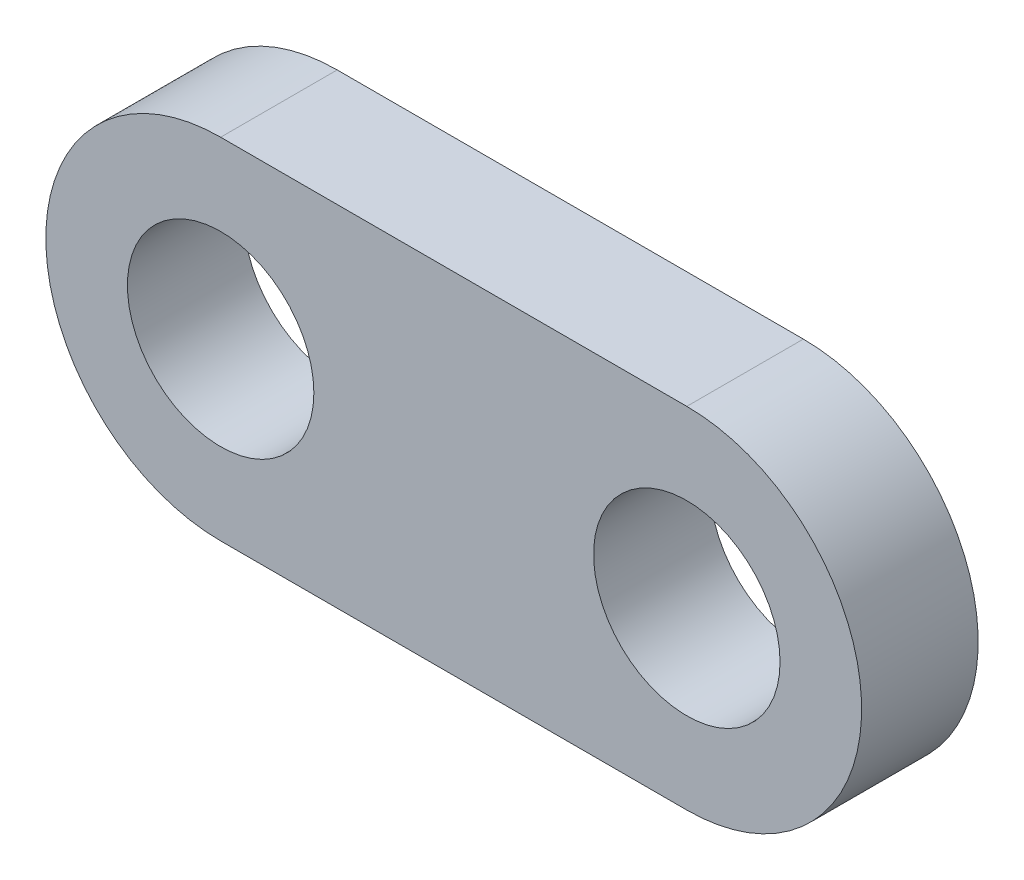
ISO-10303-21;
HEADER;
FILE_DESCRIPTION(('STEP AP214'),'2;1');
FILE_NAME('part.step','',(''),(''),'','','');
FILE_SCHEMA(('AUTOMOTIVE_DESIGN { 1 0 10303 214 1 1 1 1 }'));
ENDSEC;
DATA;
#1=APPLICATION_CONTEXT('core data for automotive mechanical design processes');
#2=APPLICATION_PROTOCOL_DEFINITION('international standard','automotive_design',2000,#1);
#3=PRODUCT_CONTEXT('',#1,'mechanical');
#4=PRODUCT('Part','Part','',(#3));
#5=PRODUCT_RELATED_PRODUCT_CATEGORY('part','',(#4));
#6=PRODUCT_DEFINITION_FORMATION('','',#4);
#7=PRODUCT_DEFINITION_CONTEXT('part definition',#1,'design');
#8=PRODUCT_DEFINITION('design','',#6,#7);
#9=PRODUCT_DEFINITION_SHAPE('','',#8);
#10=(LENGTH_UNIT() NAMED_UNIT(*) SI_UNIT(.MILLI.,.METRE.));
#11=(NAMED_UNIT(*) PLANE_ANGLE_UNIT() SI_UNIT($,.RADIAN.));
#12=(NAMED_UNIT(*) SI_UNIT($,.STERADIAN.) SOLID_ANGLE_UNIT());
#13=UNCERTAINTY_MEASURE_WITH_UNIT(LENGTH_MEASURE(1.E-05),#10,'distance_accuracy_value','');
#14=(GEOMETRIC_REPRESENTATION_CONTEXT(3) GLOBAL_UNCERTAINTY_ASSIGNED_CONTEXT((#13)) GLOBAL_UNIT_ASSIGNED_CONTEXT((#10,
#11,#12)) REPRESENTATION_CONTEXT('',''));
#15=CARTESIAN_POINT('',(0.,0.,0.));
#16=DIRECTION('',(0.,0.,1.));
#17=DIRECTION('',(1.,0.,0.));
#18=AXIS2_PLACEMENT_3D('',#15,#16,#17);
#19=CARTESIAN_POINT('',(0.,0.,-5.));
#20=DIRECTION('',(0.,0.,1.));
#21=DIRECTION('',(1.,0.,0.));
#22=AXIS2_PLACEMENT_3D('',#19,#20,#21);
#23=CYLINDRICAL_SURFACE('',#22,7.5);
#24=CARTESIAN_POINT('',(0.,0.,0.));
#25=DIRECTION('',(0.,0.,1.));
#26=DIRECTION('',(1.,0.,0.));
#27=AXIS2_PLACEMENT_3D('',#24,#25,#26);
#28=CIRCLE('',#27,7.5);
#29=CARTESIAN_POINT('',(0.,7.5,0.));
#30=VERTEX_POINT('',#29);
#31=CARTESIAN_POINT('',(0.,-7.5,0.));
#32=VERTEX_POINT('',#31);
#33=EDGE_CURVE('E97',#30,#32,#28,.T.);
#34=ORIENTED_EDGE('',*,*,#33,.F.);
#35=DIRECTION('',(0.,0.,1.));
#36=VECTOR('',#35,1.);
#37=CARTESIAN_POINT('',(0.,7.5,-5.));
#38=LINE('',#37,#36);
#39=CARTESIAN_POINT('',(0.,7.5,-5.));
#40=VERTEX_POINT('',#39);
#41=EDGE_CURVE('E11',#40,#30,#38,.T.);
#42=ORIENTED_EDGE('',*,*,#41,.F.);
#43=CARTESIAN_POINT('',(0.,0.,-5.));
#44=DIRECTION('',(0.,0.,1.));
#45=DIRECTION('',(1.,0.,0.));
#46=AXIS2_PLACEMENT_3D('',#43,#44,#45);
#47=CIRCLE('',#46,7.5);
#48=CARTESIAN_POINT('',(0.,-7.5,-5.));
#49=VERTEX_POINT('',#48);
#50=EDGE_CURVE('E90',#40,#49,#47,.T.);
#51=ORIENTED_EDGE('',*,*,#50,.T.);
#52=DIRECTION('',(0.,0.,1.));
#53=VECTOR('',#52,1.);
#54=CARTESIAN_POINT('',(0.,-7.5,-5.));
#55=LINE('',#54,#53);
#56=EDGE_CURVE('E35',#49,#32,#55,.T.);
#57=ORIENTED_EDGE('',*,*,#56,.T.);
#58=EDGE_LOOP('',(#34,#42,#51,#57));
#59=FACE_BOUND('',#58,.T.);
#60=ADVANCED_FACE('F32',(#59),#23,.T.);
#61=CARTESIAN_POINT('',(0.,7.5,-5.));
#62=DIRECTION('',(0.,1.,0.));
#63=DIRECTION('',(0.,0.,1.));
#64=AXIS2_PLACEMENT_3D('',#61,#62,#63);
#65=PLANE('',#64);
#66=DIRECTION('',(-1.,0.,0.));
#67=VECTOR('',#66,1.);
#68=CARTESIAN_POINT('',(0.,7.5,0.));
#69=LINE('',#68,#67);
#70=CARTESIAN_POINT('',(20.,7.5,0.));
#71=VERTEX_POINT('',#70);
#72=EDGE_CURVE('E92',#71,#30,#69,.T.);
#73=ORIENTED_EDGE('',*,*,#72,.F.);
#74=DIRECTION('',(0.,0.,1.));
#75=VECTOR('',#74,1.);
#76=CARTESIAN_POINT('',(20.,7.5,-5.));
#77=LINE('',#76,#75);
#78=CARTESIAN_POINT('',(20.,7.5,-5.));
#79=VERTEX_POINT('',#78);
#80=EDGE_CURVE('E41',#79,#71,#77,.T.);
#81=ORIENTED_EDGE('',*,*,#80,.F.);
#82=DIRECTION('',(-1.,0.,0.));
#83=VECTOR('',#82,1.);
#84=CARTESIAN_POINT('',(0.,7.5,-5.));
#85=LINE('',#84,#83);
#86=EDGE_CURVE('E87',#79,#40,#85,.T.);
#87=ORIENTED_EDGE('',*,*,#86,.T.);
#88=ORIENTED_EDGE('',*,*,#41,.T.);
#89=EDGE_LOOP('',(#73,#81,#87,#88));
#90=FACE_BOUND('',#89,.T.);
#91=ADVANCED_FACE('F108',(#90),#65,.T.);
#92=CARTESIAN_POINT('',(20.,0.,-5.));
#93=DIRECTION('',(0.,0.,1.));
#94=DIRECTION('',(1.,0.,0.));
#95=AXIS2_PLACEMENT_3D('',#92,#93,#94);
#96=CYLINDRICAL_SURFACE('',#95,7.5);
#97=CARTESIAN_POINT('',(20.,0.,0.));
#98=DIRECTION('',(0.,0.,1.));
#99=DIRECTION('',(1.,0.,0.));
#100=AXIS2_PLACEMENT_3D('',#97,#98,#99);
#101=CIRCLE('',#100,7.5);
#102=CARTESIAN_POINT('',(20.,-7.5,0.));
#103=VERTEX_POINT('',#102);
#104=EDGE_CURVE('E82',#103,#71,#101,.T.);
#105=ORIENTED_EDGE('',*,*,#104,.F.);
#106=DIRECTION('',(0.,0.,1.));
#107=VECTOR('',#106,1.);
#108=CARTESIAN_POINT('',(20.,-7.5,-5.));
#109=LINE('',#108,#107);
#110=CARTESIAN_POINT('',(20.,-7.5,-5.));
#111=VERTEX_POINT('',#110);
#112=EDGE_CURVE('E77',#111,#103,#109,.T.);
#113=ORIENTED_EDGE('',*,*,#112,.F.);
#114=CARTESIAN_POINT('',(20.,0.,-5.));
#115=DIRECTION('',(0.,0.,1.));
#116=DIRECTION('',(1.,0.,0.));
#117=AXIS2_PLACEMENT_3D('',#114,#115,#116);
#118=CIRCLE('',#117,7.5);
#119=EDGE_CURVE('E80',#111,#79,#118,.T.);
#120=ORIENTED_EDGE('',*,*,#119,.T.);
#121=ORIENTED_EDGE('',*,*,#80,.T.);
#122=EDGE_LOOP('',(#105,#113,#120,#121));
#123=FACE_BOUND('',#122,.T.);
#124=ADVANCED_FACE('F79',(#123),#96,.T.);
#125=CARTESIAN_POINT('',(0.,-7.5,-5.));
#126=DIRECTION('',(0.,-1.,0.));
#127=DIRECTION('',(1.,0.,0.));
#128=AXIS2_PLACEMENT_3D('',#125,#126,#127);
#129=PLANE('',#128);
#130=DIRECTION('',(1.,0.,0.));
#131=VECTOR('',#130,1.);
#132=CARTESIAN_POINT('',(0.,-7.5,0.));
#133=LINE('',#132,#131);
#134=EDGE_CURVE('E100',#32,#103,#133,.T.);
#135=ORIENTED_EDGE('',*,*,#134,.F.);
#136=ORIENTED_EDGE('',*,*,#56,.F.);
#137=DIRECTION('',(1.,0.,0.));
#138=VECTOR('',#137,1.);
#139=CARTESIAN_POINT('',(0.,-7.5,-5.));
#140=LINE('',#139,#138);
#141=EDGE_CURVE('E86',#49,#111,#140,.T.);
#142=ORIENTED_EDGE('',*,*,#141,.T.);
#143=ORIENTED_EDGE('',*,*,#112,.T.);
#144=EDGE_LOOP('',(#135,#136,#142,#143));
#145=FACE_BOUND('',#144,.T.);
#146=ADVANCED_FACE('F89',(#145),#129,.T.);
#147=CARTESIAN_POINT('',(0.,0.,-5.));
#148=DIRECTION('',(0.,0.,1.));
#149=DIRECTION('',(1.,0.,0.));
#150=AXIS2_PLACEMENT_3D('',#147,#148,#149);
#151=PLANE('',#150);
#152=CARTESIAN_POINT('',(20.,0.,-5.));
#153=DIRECTION('',(0.,0.,1.));
#154=DIRECTION('',(1.,0.,0.));
#155=AXIS2_PLACEMENT_3D('',#152,#153,#154);
#156=CIRCLE('',#155,4.);
#157=CARTESIAN_POINT('',(24.,0.,-5.));
#158=VERTEX_POINT('',#157);
#159=EDGE_CURVE('E141',#158,#158,#156,.T.);
#160=ORIENTED_EDGE('',*,*,#159,.T.);
#161=EDGE_LOOP('',(#160));
#162=FACE_BOUND('',#161,.T.);
#163=CARTESIAN_POINT('',(0.,0.,-5.));
#164=DIRECTION('',(0.,0.,1.));
#165=DIRECTION('',(1.,0.,0.));
#166=AXIS2_PLACEMENT_3D('',#163,#164,#165);
#167=CIRCLE('',#166,4.);
#168=CARTESIAN_POINT('',(4.,0.,-5.));
#169=VERTEX_POINT('',#168);
#170=EDGE_CURVE('E101',#169,#169,#167,.T.);
#171=ORIENTED_EDGE('',*,*,#170,.T.);
#172=EDGE_LOOP('',(#171));
#173=FACE_BOUND('',#172,.T.);
#174=ORIENTED_EDGE('',*,*,#50,.F.);
#175=ORIENTED_EDGE('',*,*,#86,.F.);
#176=ORIENTED_EDGE('',*,*,#119,.F.);
#177=ORIENTED_EDGE('',*,*,#141,.F.);
#178=EDGE_LOOP('',(#174,#175,#176,#177));
#179=FACE_BOUND('',#178,.T.);
#180=ADVANCED_FACE('F85',(#162,#173,#179),#151,.F.);
#181=CARTESIAN_POINT('',(0.,0.,0.));
#182=DIRECTION('',(0.,0.,1.));
#183=DIRECTION('',(1.,0.,0.));
#184=AXIS2_PLACEMENT_3D('',#181,#182,#183);
#185=PLANE('',#184);
#186=CARTESIAN_POINT('',(20.,0.,0.));
#187=DIRECTION('',(0.,0.,1.));
#188=DIRECTION('',(1.,0.,0.));
#189=AXIS2_PLACEMENT_3D('',#186,#187,#188);
#190=CIRCLE('',#189,4.);
#191=CARTESIAN_POINT('',(24.,0.,0.));
#192=VERTEX_POINT('',#191);
#193=EDGE_CURVE('E144',#192,#192,#190,.T.);
#194=ORIENTED_EDGE('',*,*,#193,.F.);
#195=EDGE_LOOP('',(#194));
#196=FACE_BOUND('',#195,.T.);
#197=CARTESIAN_POINT('',(0.,0.,0.));
#198=DIRECTION('',(0.,0.,1.));
#199=DIRECTION('',(1.,0.,0.));
#200=AXIS2_PLACEMENT_3D('',#197,#198,#199);
#201=CIRCLE('',#200,4.);
#202=CARTESIAN_POINT('',(4.,0.,0.));
#203=VERTEX_POINT('',#202);
#204=EDGE_CURVE('E146',#203,#203,#201,.T.);
#205=ORIENTED_EDGE('',*,*,#204,.F.);
#206=EDGE_LOOP('',(#205));
#207=FACE_BOUND('',#206,.T.);
#208=ORIENTED_EDGE('',*,*,#33,.T.);
#209=ORIENTED_EDGE('',*,*,#134,.T.);
#210=ORIENTED_EDGE('',*,*,#104,.T.);
#211=ORIENTED_EDGE('',*,*,#72,.T.);
#212=EDGE_LOOP('',(#208,#209,#210,#211));
#213=FACE_BOUND('',#212,.T.);
#214=ADVANCED_FACE('F107',(#196,#207,#213),#185,.T.);
#215=CARTESIAN_POINT('',(0.,0.,-5.));
#216=DIRECTION('',(0.,0.,1.));
#217=DIRECTION('',(1.,0.,0.));
#218=AXIS2_PLACEMENT_3D('',#215,#216,#217);
#219=CYLINDRICAL_SURFACE('',#218,4.);
#220=ORIENTED_EDGE('',*,*,#170,.F.);
#221=EDGE_LOOP('',(#220));
#222=FACE_BOUND('',#221,.T.);
#223=ORIENTED_EDGE('',*,*,#204,.T.);
#224=EDGE_LOOP('',(#223));
#225=FACE_BOUND('',#224,.T.);
#226=ADVANCED_FACE('F126',(#222,#225),#219,.F.);
#227=CARTESIAN_POINT('',(20.,0.,-5.));
#228=DIRECTION('',(0.,0.,1.));
#229=DIRECTION('',(1.,0.,0.));
#230=AXIS2_PLACEMENT_3D('',#227,#228,#229);
#231=CYLINDRICAL_SURFACE('',#230,4.);
#232=ORIENTED_EDGE('',*,*,#159,.F.);
#233=EDGE_LOOP('',(#232));
#234=FACE_BOUND('',#233,.T.);
#235=ORIENTED_EDGE('',*,*,#193,.T.);
#236=EDGE_LOOP('',(#235));
#237=FACE_BOUND('',#236,.T.);
#238=ADVANCED_FACE('F133',(#234,#237),#231,.F.);
#239=CLOSED_SHELL('',(#60,#91,#124,#146,#180,#214,#226,#238));
#240=MANIFOLD_SOLID_BREP('B2',#239);
#241=ADVANCED_BREP_SHAPE_REPRESENTATION('',(#18,#240),#14);
#242=SHAPE_DEFINITION_REPRESENTATION(#9,#241);
ENDSEC;
END-ISO-10303-21;
